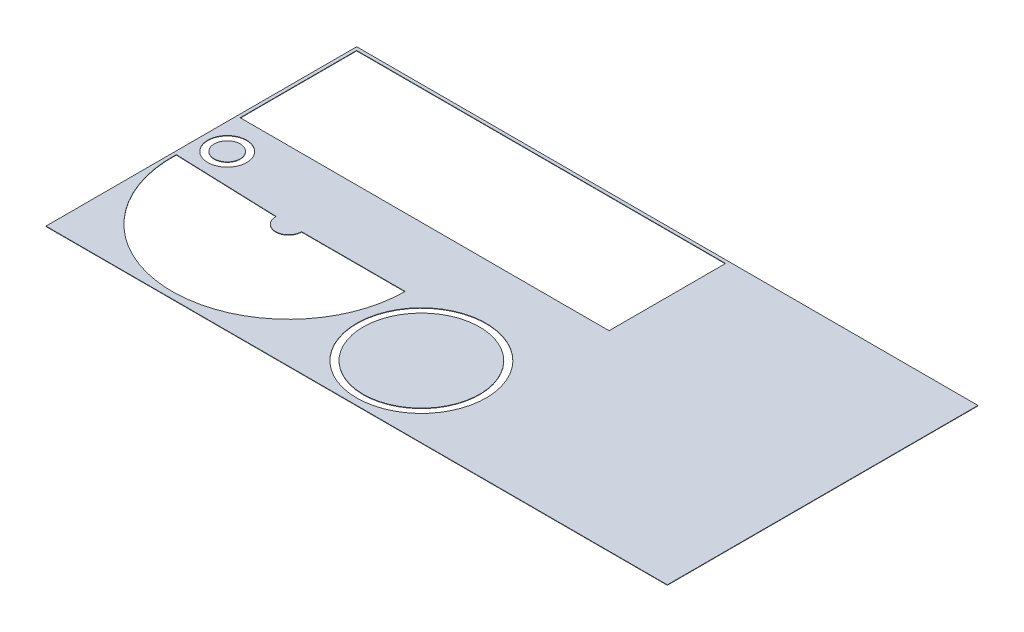
ISO-10303-21;
HEADER;
FILE_DESCRIPTION(('STEP AP214'),'2;1');
FILE_NAME('part.step','',(''),(''),'','','');
FILE_SCHEMA(('AUTOMOTIVE_DESIGN { 1 0 10303 214 1 1 1 1 }'));
ENDSEC;
DATA;
#1=APPLICATION_CONTEXT('core data for automotive mechanical design processes');
#2=APPLICATION_PROTOCOL_DEFINITION('international standard','automotive_design',2000,#1);
#3=PRODUCT_CONTEXT('',#1,'mechanical');
#4=PRODUCT('Part','Part','',(#3));
#5=PRODUCT_RELATED_PRODUCT_CATEGORY('part','',(#4));
#6=PRODUCT_DEFINITION_FORMATION('','',#4);
#7=PRODUCT_DEFINITION_CONTEXT('part definition',#1,'design');
#8=PRODUCT_DEFINITION('design','',#6,#7);
#9=PRODUCT_DEFINITION_SHAPE('','',#8);
#10=(LENGTH_UNIT() NAMED_UNIT(*) SI_UNIT(.MILLI.,.METRE.));
#11=(NAMED_UNIT(*) PLANE_ANGLE_UNIT() SI_UNIT($,.RADIAN.));
#12=(NAMED_UNIT(*) SI_UNIT($,.STERADIAN.) SOLID_ANGLE_UNIT());
#13=UNCERTAINTY_MEASURE_WITH_UNIT(LENGTH_MEASURE(1.E-05),#10,'distance_accuracy_value','');
#14=(GEOMETRIC_REPRESENTATION_CONTEXT(3) GLOBAL_UNCERTAINTY_ASSIGNED_CONTEXT((#13)) GLOBAL_UNIT_ASSIGNED_CONTEXT((#10,
#11,#12)) REPRESENTATION_CONTEXT('',''));
#15=CARTESIAN_POINT('',(0.,0.,0.));
#16=DIRECTION('',(0.,0.,1.));
#17=DIRECTION('',(1.,0.,0.));
#18=AXIS2_PLACEMENT_3D('',#15,#16,#17);
#19=CARTESIAN_POINT('',(1219.2,-1.5875,609.6));
#20=DIRECTION('',(1.,0.,0.));
#21=DIRECTION('',(0.,0.,-1.));
#22=AXIS2_PLACEMENT_3D('',#19,#20,#21);
#23=PLANE('',#22);
#24=DIRECTION('',(0.,0.,-1.));
#25=VECTOR('',#24,1.);
#26=CARTESIAN_POINT('',(1219.2,0.,609.6));
#27=LINE('',#26,#25);
#28=CARTESIAN_POINT('',(1219.2,0.,609.6));
#29=VERTEX_POINT('',#28);
#30=CARTESIAN_POINT('',(1219.2,0.,-609.6));
#31=VERTEX_POINT('',#30);
#32=EDGE_CURVE('E186',#29,#31,#27,.T.);
#33=ORIENTED_EDGE('',*,*,#32,.F.);
#34=DIRECTION('',(0.,1.,0.));
#35=VECTOR('',#34,1.);
#36=CARTESIAN_POINT('',(1219.2,-1.5875,609.6));
#37=LINE('',#36,#35);
#38=CARTESIAN_POINT('',(1219.2,-1.5875,609.6));
#39=VERTEX_POINT('',#38);
#40=EDGE_CURVE('E219',#39,#29,#37,.T.);
#41=ORIENTED_EDGE('',*,*,#40,.F.);
#42=DIRECTION('',(0.,0.,-1.));
#43=VECTOR('',#42,1.);
#44=CARTESIAN_POINT('',(1219.2,-1.5875,609.6));
#45=LINE('',#44,#43);
#46=CARTESIAN_POINT('',(1219.2,-1.5875,-609.6));
#47=VERTEX_POINT('',#46);
#48=EDGE_CURVE('E207',#39,#47,#45,.T.);
#49=ORIENTED_EDGE('',*,*,#48,.T.);
#50=DIRECTION('',(0.,1.,0.));
#51=VECTOR('',#50,1.);
#52=CARTESIAN_POINT('',(1219.2,-1.5875,-609.6));
#53=LINE('',#52,#51);
#54=EDGE_CURVE('E210',#47,#31,#53,.T.);
#55=ORIENTED_EDGE('',*,*,#54,.T.);
#56=EDGE_LOOP('',(#33,#41,#49,#55));
#57=FACE_BOUND('',#56,.T.);
#58=ADVANCED_FACE('F47',(#57),#23,.T.);
#59=CARTESIAN_POINT('',(-1219.2,-1.5875,609.6));
#60=DIRECTION('',(0.,0.,1.));
#61=DIRECTION('',(1.,0.,0.));
#62=AXIS2_PLACEMENT_3D('',#59,#60,#61);
#63=PLANE('',#62);
#64=DIRECTION('',(1.,0.,0.));
#65=VECTOR('',#64,1.);
#66=CARTESIAN_POINT('',(-1219.2,0.,609.6));
#67=LINE('',#66,#65);
#68=CARTESIAN_POINT('',(-1219.2,0.,609.6));
#69=VERTEX_POINT('',#68);
#70=EDGE_CURVE('E190',#69,#29,#67,.T.);
#71=ORIENTED_EDGE('',*,*,#70,.F.);
#72=DIRECTION('',(0.,1.,0.));
#73=VECTOR('',#72,1.);
#74=CARTESIAN_POINT('',(-1219.2,-1.5875,609.6));
#75=LINE('',#74,#73);
#76=CARTESIAN_POINT('',(-1219.2,-1.5875,609.6));
#77=VERTEX_POINT('',#76);
#78=EDGE_CURVE('E215',#77,#69,#75,.T.);
#79=ORIENTED_EDGE('',*,*,#78,.F.);
#80=DIRECTION('',(1.,0.,0.));
#81=VECTOR('',#80,1.);
#82=CARTESIAN_POINT('',(-1219.2,-1.5875,609.6));
#83=LINE('',#82,#81);
#84=EDGE_CURVE('E220',#77,#39,#83,.T.);
#85=ORIENTED_EDGE('',*,*,#84,.T.);
#86=ORIENTED_EDGE('',*,*,#40,.T.);
#87=EDGE_LOOP('',(#71,#79,#85,#86));
#88=FACE_BOUND('',#87,.T.);
#89=ADVANCED_FACE('F248',(#88),#63,.T.);
#90=CARTESIAN_POINT('',(-1219.2,-1.5875,609.6));
#91=DIRECTION('',(-1.,0.,0.));
#92=DIRECTION('',(0.,0.,1.));
#93=AXIS2_PLACEMENT_3D('',#90,#91,#92);
#94=PLANE('',#93);
#95=DIRECTION('',(0.,0.,1.));
#96=VECTOR('',#95,1.);
#97=CARTESIAN_POINT('',(-1219.2,0.,609.6));
#98=LINE('',#97,#96);
#99=CARTESIAN_POINT('',(-1219.2,0.,-609.6));
#100=VERTEX_POINT('',#99);
#101=EDGE_CURVE('E228',#100,#69,#98,.T.);
#102=ORIENTED_EDGE('',*,*,#101,.F.);
#103=DIRECTION('',(0.,1.,0.));
#104=VECTOR('',#103,1.);
#105=CARTESIAN_POINT('',(-1219.2,-1.5875,-609.6));
#106=LINE('',#105,#104);
#107=CARTESIAN_POINT('',(-1219.2,-1.5875,-609.6));
#108=VERTEX_POINT('',#107);
#109=EDGE_CURVE('E214',#108,#100,#106,.T.);
#110=ORIENTED_EDGE('',*,*,#109,.F.);
#111=DIRECTION('',(0.,0.,1.));
#112=VECTOR('',#111,1.);
#113=CARTESIAN_POINT('',(-1219.2,-1.5875,609.6));
#114=LINE('',#113,#112);
#115=EDGE_CURVE('E216',#108,#77,#114,.T.);
#116=ORIENTED_EDGE('',*,*,#115,.T.);
#117=ORIENTED_EDGE('',*,*,#78,.T.);
#118=EDGE_LOOP('',(#102,#110,#116,#117));
#119=FACE_BOUND('',#118,.T.);
#120=ADVANCED_FACE('F253',(#119),#94,.T.);
#121=CARTESIAN_POINT('',(-1219.2,-1.5875,-609.6));
#122=DIRECTION('',(0.,0.,-1.));
#123=DIRECTION('',(-1.,0.,0.));
#124=AXIS2_PLACEMENT_3D('',#121,#122,#123);
#125=PLANE('',#124);
#126=DIRECTION('',(-1.,0.,0.));
#127=VECTOR('',#126,1.);
#128=CARTESIAN_POINT('',(-1219.2,0.,-609.6));
#129=LINE('',#128,#127);
#130=EDGE_CURVE('E225',#31,#100,#129,.T.);
#131=ORIENTED_EDGE('',*,*,#130,.F.);
#132=ORIENTED_EDGE('',*,*,#54,.F.);
#133=DIRECTION('',(-1.,0.,0.));
#134=VECTOR('',#133,1.);
#135=CARTESIAN_POINT('',(-1219.2,-1.5875,-609.6));
#136=LINE('',#135,#134);
#137=EDGE_CURVE('E211',#47,#108,#136,.T.);
#138=ORIENTED_EDGE('',*,*,#137,.T.);
#139=ORIENTED_EDGE('',*,*,#109,.T.);
#140=EDGE_LOOP('',(#131,#132,#138,#139));
#141=FACE_BOUND('',#140,.T.);
#142=ADVANCED_FACE('F242',(#141),#125,.T.);
#143=CARTESIAN_POINT('',(0.,-1.5875,0.));
#144=DIRECTION('',(0.,-1.,0.));
#145=DIRECTION('',(0.,0.,-1.));
#146=AXIS2_PLACEMENT_3D('',#143,#144,#145);
#147=PLANE('',#146);
#148=CARTESIAN_POINT('',(-1117.6,-1.5875,0.));
#149=DIRECTION('',(0.,1.,0.));
#150=DIRECTION('',(0.,0.,1.));
#151=AXIS2_PLACEMENT_3D('',#148,#149,#150);
#152=CIRCLE('',#151,76.2);
#153=CARTESIAN_POINT('',(-1117.6,-1.5875,76.2));
#154=VERTEX_POINT('',#153);
#155=EDGE_CURVE('E51',#154,#154,#152,.T.);
#156=ORIENTED_EDGE('',*,*,#155,.T.);
#157=EDGE_LOOP('',(#156));
#158=FACE_BOUND('',#157,.T.);
#159=CARTESIAN_POINT('',(-25.4000000000001,-1.5875,330.2));
#160=DIRECTION('',(0.,1.,0.));
#161=DIRECTION('',(0.,0.,1.));
#162=AXIS2_PLACEMENT_3D('',#159,#160,#161);
#163=CIRCLE('',#162,254.);
#164=CARTESIAN_POINT('',(-25.4000000000001,-1.5875,584.2));
#165=VERTEX_POINT('',#164);
#166=EDGE_CURVE('E330',#165,#165,#163,.T.);
#167=ORIENTED_EDGE('',*,*,#166,.T.);
#168=EDGE_LOOP('',(#167));
#169=FACE_BOUND('',#168,.T.);
#170=CARTESIAN_POINT('',(-749.57851388687,-1.5875,127.));
#171=DIRECTION('',(0.,-1.,0.));
#172=DIRECTION('',(0.,0.,1.));
#173=AXIS2_PLACEMENT_3D('',#170,#171,#172);
#174=CIRCLE('',#173,50.8);
#175=CARTESIAN_POINT('',(-698.77851388687,-1.5875,127.));
#176=VERTEX_POINT('',#175);
#177=CARTESIAN_POINT('',(-800.34756789944,-1.5875,125.227105567513));
#178=VERTEX_POINT('',#177);
#179=EDGE_CURVE('E162',#176,#178,#174,.T.);
#180=ORIENTED_EDGE('',*,*,#179,.T.);
#181=DIRECTION('',(-0.999390827019096,0.,-0.0348994967025008));
#182=VECTOR('',#181,1.);
#183=CARTESIAN_POINT('',(-1206.5,-1.5875,111.043950107617));
#184=LINE('',#183,#182);
#185=CARTESIAN_POINT('',(-1206.5,-1.5875,111.043950107617));
#186=VERTEX_POINT('',#185);
#187=EDGE_CURVE('E160',#178,#186,#184,.T.);
#188=ORIENTED_EDGE('',*,*,#187,.T.);
#189=CARTESIAN_POINT('',(-749.57851388687,-1.5875,127.));
#190=DIRECTION('',(0.,1.,0.));
#191=DIRECTION('',(0.,0.,-1.));
#192=AXIS2_PLACEMENT_3D('',#189,#190,#191);
#193=CIRCLE('',#192,457.2);
#194=CARTESIAN_POINT('',(-292.37851388687,-1.5875,127.));
#195=VERTEX_POINT('',#194);
#196=EDGE_CURVE('E141',#186,#195,#193,.T.);
#197=ORIENTED_EDGE('',*,*,#196,.T.);
#198=DIRECTION('',(-1.,0.,0.));
#199=VECTOR('',#198,1.);
#200=CARTESIAN_POINT('',(-698.77851388687,-1.5875,127.));
#201=LINE('',#200,#199);
#202=EDGE_CURVE('E151',#195,#176,#201,.T.);
#203=ORIENTED_EDGE('',*,*,#202,.T.);
#204=EDGE_LOOP('',(#180,#188,#197,#203));
#205=FACE_BOUND('',#204,.T.);
#206=DIRECTION('',(0.,0.,1.));
#207=VECTOR('',#206,1.);
#208=CARTESIAN_POINT('',(-1206.5,-1.5875,-596.9));
#209=LINE('',#208,#207);
#210=CARTESIAN_POINT('',(-1206.5,-1.5875,-596.9));
#211=VERTEX_POINT('',#210);
#212=CARTESIAN_POINT('',(-1206.5,-1.5875,-139.7));
#213=VERTEX_POINT('',#212);
#214=EDGE_CURVE('E156',#211,#213,#209,.T.);
#215=ORIENTED_EDGE('',*,*,#214,.T.);
#216=DIRECTION('',(1.,0.,0.));
#217=VECTOR('',#216,1.);
#218=CARTESIAN_POINT('',(-1206.5,-1.5875,-139.7));
#219=LINE('',#218,#217);
#220=CARTESIAN_POINT('',(241.3,-1.5875,-139.7));
#221=VERTEX_POINT('',#220);
#222=EDGE_CURVE('E177',#213,#221,#219,.T.);
#223=ORIENTED_EDGE('',*,*,#222,.T.);
#224=DIRECTION('',(0.,0.,-1.));
#225=VECTOR('',#224,1.);
#226=CARTESIAN_POINT('',(241.3,-1.5875,-596.9));
#227=LINE('',#226,#225);
#228=CARTESIAN_POINT('',(241.3,-1.5875,-596.9));
#229=VERTEX_POINT('',#228);
#230=EDGE_CURVE('E180',#221,#229,#227,.T.);
#231=ORIENTED_EDGE('',*,*,#230,.T.);
#232=DIRECTION('',(-1.,0.,0.));
#233=VECTOR('',#232,1.);
#234=CARTESIAN_POINT('',(-1206.5,-1.5875,-596.9));
#235=LINE('',#234,#233);
#236=EDGE_CURVE('E183',#229,#211,#235,.T.);
#237=ORIENTED_EDGE('',*,*,#236,.T.);
#238=EDGE_LOOP('',(#215,#223,#231,#237));
#239=FACE_BOUND('',#238,.T.);
#240=ORIENTED_EDGE('',*,*,#48,.F.);
#241=ORIENTED_EDGE('',*,*,#84,.F.);
#242=ORIENTED_EDGE('',*,*,#115,.F.);
#243=ORIENTED_EDGE('',*,*,#137,.F.);
#244=EDGE_LOOP('',(#240,#241,#242,#243));
#245=FACE_BOUND('',#244,.T.);
#246=ADVANCED_FACE('F49',(#158,#169,#205,#239,#245),#147,.T.);
#247=CARTESIAN_POINT('',(0.,0.,0.));
#248=DIRECTION('',(0.,-1.,0.));
#249=DIRECTION('',(0.,0.,-1.));
#250=AXIS2_PLACEMENT_3D('',#247,#248,#249);
#251=PLANE('',#250);
#252=CARTESIAN_POINT('',(-1117.6,0.,0.));
#253=DIRECTION('',(0.,1.,0.));
#254=DIRECTION('',(0.,0.,1.));
#255=AXIS2_PLACEMENT_3D('',#252,#253,#254);
#256=CIRCLE('',#255,76.2);
#257=CARTESIAN_POINT('',(-1117.6,0.,76.2));
#258=VERTEX_POINT('',#257);
#259=EDGE_CURVE('E12',#258,#258,#256,.T.);
#260=ORIENTED_EDGE('',*,*,#259,.F.);
#261=EDGE_LOOP('',(#260));
#262=FACE_BOUND('',#261,.T.);
#263=CARTESIAN_POINT('',(-25.4000000000001,0.,330.2));
#264=DIRECTION('',(0.,1.,0.));
#265=DIRECTION('',(0.,0.,1.));
#266=AXIS2_PLACEMENT_3D('',#263,#264,#265);
#267=CIRCLE('',#266,254.);
#268=CARTESIAN_POINT('',(-25.4000000000001,0.,584.2));
#269=VERTEX_POINT('',#268);
#270=EDGE_CURVE('E57',#269,#269,#267,.T.);
#271=ORIENTED_EDGE('',*,*,#270,.F.);
#272=EDGE_LOOP('',(#271));
#273=FACE_BOUND('',#272,.T.);
#274=DIRECTION('',(-0.999390827019096,0.,-0.0348994967025008));
#275=VECTOR('',#274,1.);
#276=CARTESIAN_POINT('',(-1206.5,0.,111.043950107617));
#277=LINE('',#276,#275);
#278=CARTESIAN_POINT('',(-800.347567899439,0.,125.227105567513));
#279=VERTEX_POINT('',#278);
#280=CARTESIAN_POINT('',(-1206.5,0.,111.043950107617));
#281=VERTEX_POINT('',#280);
#282=EDGE_CURVE('E168',#279,#281,#277,.T.);
#283=ORIENTED_EDGE('',*,*,#282,.F.);
#284=CARTESIAN_POINT('',(-749.57851388687,0.,127.));
#285=DIRECTION('',(0.,-1.,0.));
#286=DIRECTION('',(0.,0.,1.));
#287=AXIS2_PLACEMENT_3D('',#284,#285,#286);
#288=CIRCLE('',#287,50.8);
#289=CARTESIAN_POINT('',(-698.77851388687,0.,127.));
#290=VERTEX_POINT('',#289);
#291=EDGE_CURVE('E130',#290,#279,#288,.T.);
#292=ORIENTED_EDGE('',*,*,#291,.F.);
#293=DIRECTION('',(-1.,0.,0.));
#294=VECTOR('',#293,1.);
#295=CARTESIAN_POINT('',(-698.77851388687,0.,127.));
#296=LINE('',#295,#294);
#297=CARTESIAN_POINT('',(-292.37851388687,0.,127.));
#298=VERTEX_POINT('',#297);
#299=EDGE_CURVE('E147',#298,#290,#296,.T.);
#300=ORIENTED_EDGE('',*,*,#299,.F.);
#301=CARTESIAN_POINT('',(-749.57851388687,0.,127.));
#302=DIRECTION('',(0.,1.,0.));
#303=DIRECTION('',(0.,0.,-1.));
#304=AXIS2_PLACEMENT_3D('',#301,#302,#303);
#305=CIRCLE('',#304,457.2);
#306=EDGE_CURVE('E143',#281,#298,#305,.T.);
#307=ORIENTED_EDGE('',*,*,#306,.F.);
#308=EDGE_LOOP('',(#283,#292,#300,#307));
#309=FACE_BOUND('',#308,.T.);
#310=DIRECTION('',(1.,0.,0.));
#311=VECTOR('',#310,1.);
#312=CARTESIAN_POINT('',(-1206.5,0.,-139.7));
#313=LINE('',#312,#311);
#314=CARTESIAN_POINT('',(-1206.5,0.,-139.7));
#315=VERTEX_POINT('',#314);
#316=CARTESIAN_POINT('',(241.3,0.,-139.7));
#317=VERTEX_POINT('',#316);
#318=EDGE_CURVE('E191',#315,#317,#313,.T.);
#319=ORIENTED_EDGE('',*,*,#318,.F.);
#320=DIRECTION('',(0.,0.,1.));
#321=VECTOR('',#320,1.);
#322=CARTESIAN_POINT('',(-1206.5,0.,-596.9));
#323=LINE('',#322,#321);
#324=CARTESIAN_POINT('',(-1206.5,0.,-596.9));
#325=VERTEX_POINT('',#324);
#326=EDGE_CURVE('E187',#325,#315,#323,.T.);
#327=ORIENTED_EDGE('',*,*,#326,.F.);
#328=DIRECTION('',(-1.,0.,0.));
#329=VECTOR('',#328,1.);
#330=CARTESIAN_POINT('',(-1206.5,0.,-596.9));
#331=LINE('',#330,#329);
#332=CARTESIAN_POINT('',(241.3,0.,-596.9));
#333=VERTEX_POINT('',#332);
#334=EDGE_CURVE('E199',#333,#325,#331,.T.);
#335=ORIENTED_EDGE('',*,*,#334,.F.);
#336=DIRECTION('',(0.,0.,-1.));
#337=VECTOR('',#336,1.);
#338=CARTESIAN_POINT('',(241.3,0.,-596.9));
#339=LINE('',#338,#337);
#340=EDGE_CURVE('E195',#317,#333,#339,.T.);
#341=ORIENTED_EDGE('',*,*,#340,.F.);
#342=EDGE_LOOP('',(#319,#327,#335,#341));
#343=FACE_BOUND('',#342,.T.);
#344=ORIENTED_EDGE('',*,*,#32,.T.);
#345=ORIENTED_EDGE('',*,*,#130,.T.);
#346=ORIENTED_EDGE('',*,*,#101,.T.);
#347=ORIENTED_EDGE('',*,*,#70,.T.);
#348=EDGE_LOOP('',(#344,#345,#346,#347));
#349=FACE_BOUND('',#348,.T.);
#350=ADVANCED_FACE('F245',(#262,#273,#309,#343,#349),#251,.F.);
#351=CARTESIAN_POINT('',(-1206.5,-1.5875,-596.9));
#352=DIRECTION('',(-1.,0.,0.));
#353=DIRECTION('',(0.,0.,1.));
#354=AXIS2_PLACEMENT_3D('',#351,#352,#353);
#355=PLANE('',#354);
#356=ORIENTED_EDGE('',*,*,#326,.T.);
#357=DIRECTION('',(0.,1.,0.));
#358=VECTOR('',#357,1.);
#359=CARTESIAN_POINT('',(-1206.5,-1.5875,-139.7));
#360=LINE('',#359,#358);
#361=EDGE_CURVE('E167',#213,#315,#360,.T.);
#362=ORIENTED_EDGE('',*,*,#361,.F.);
#363=ORIENTED_EDGE('',*,*,#214,.F.);
#364=DIRECTION('',(0.,1.,0.));
#365=VECTOR('',#364,1.);
#366=CARTESIAN_POINT('',(-1206.5,-1.5875,-596.9));
#367=LINE('',#366,#365);
#368=EDGE_CURVE('E189',#211,#325,#367,.T.);
#369=ORIENTED_EDGE('',*,*,#368,.T.);
#370=EDGE_LOOP('',(#356,#362,#363,#369));
#371=FACE_BOUND('',#370,.T.);
#372=ADVANCED_FACE('F272',(#371),#355,.F.);
#373=CARTESIAN_POINT('',(-1206.5,-1.5875,-596.9));
#374=DIRECTION('',(0.,0.,-1.));
#375=DIRECTION('',(-1.,0.,0.));
#376=AXIS2_PLACEMENT_3D('',#373,#374,#375);
#377=PLANE('',#376);
#378=ORIENTED_EDGE('',*,*,#334,.T.);
#379=ORIENTED_EDGE('',*,*,#368,.F.);
#380=ORIENTED_EDGE('',*,*,#236,.F.);
#381=DIRECTION('',(0.,1.,0.));
#382=VECTOR('',#381,1.);
#383=CARTESIAN_POINT('',(241.3,-1.5875,-596.9));
#384=LINE('',#383,#382);
#385=EDGE_CURVE('E198',#229,#333,#384,.T.);
#386=ORIENTED_EDGE('',*,*,#385,.T.);
#387=EDGE_LOOP('',(#378,#379,#380,#386));
#388=FACE_BOUND('',#387,.T.);
#389=ADVANCED_FACE('F279',(#388),#377,.F.);
#390=CARTESIAN_POINT('',(241.3,-1.5875,-596.9));
#391=DIRECTION('',(1.,0.,0.));
#392=DIRECTION('',(0.,0.,-1.));
#393=AXIS2_PLACEMENT_3D('',#390,#391,#392);
#394=PLANE('',#393);
#395=ORIENTED_EDGE('',*,*,#340,.T.);
#396=ORIENTED_EDGE('',*,*,#385,.F.);
#397=ORIENTED_EDGE('',*,*,#230,.F.);
#398=DIRECTION('',(0.,1.,0.));
#399=VECTOR('',#398,1.);
#400=CARTESIAN_POINT('',(241.3,-1.5875,-139.7));
#401=LINE('',#400,#399);
#402=EDGE_CURVE('E194',#221,#317,#401,.T.);
#403=ORIENTED_EDGE('',*,*,#402,.T.);
#404=EDGE_LOOP('',(#395,#396,#397,#403));
#405=FACE_BOUND('',#404,.T.);
#406=ADVANCED_FACE('F302',(#405),#394,.F.);
#407=CARTESIAN_POINT('',(-1206.5,-1.5875,-139.7));
#408=DIRECTION('',(0.,0.,1.));
#409=DIRECTION('',(1.,0.,0.));
#410=AXIS2_PLACEMENT_3D('',#407,#408,#409);
#411=PLANE('',#410);
#412=ORIENTED_EDGE('',*,*,#318,.T.);
#413=ORIENTED_EDGE('',*,*,#402,.F.);
#414=ORIENTED_EDGE('',*,*,#222,.F.);
#415=ORIENTED_EDGE('',*,*,#361,.T.);
#416=EDGE_LOOP('',(#412,#413,#414,#415));
#417=FACE_BOUND('',#416,.T.);
#418=ADVANCED_FACE('F296',(#417),#411,.F.);
#419=CARTESIAN_POINT('',(-749.57851388687,-1.5875,127.));
#420=DIRECTION('',(0.,1.,0.));
#421=DIRECTION('',(0.,0.,1.));
#422=AXIS2_PLACEMENT_3D('',#419,#420,#421);
#423=CYLINDRICAL_SURFACE('',#422,50.8);
#424=ORIENTED_EDGE('',*,*,#291,.T.);
#425=DIRECTION('',(0.,1.,0.));
#426=VECTOR('',#425,1.);
#427=CARTESIAN_POINT('',(-800.34756789944,-1.5875,125.227105567513));
#428=LINE('',#427,#426);
#429=EDGE_CURVE('E134',#178,#279,#428,.T.);
#430=ORIENTED_EDGE('',*,*,#429,.F.);
#431=ORIENTED_EDGE('',*,*,#179,.F.);
#432=DIRECTION('',(0.,1.,0.));
#433=VECTOR('',#432,1.);
#434=CARTESIAN_POINT('',(-698.77851388687,-1.5875,127.));
#435=LINE('',#434,#433);
#436=EDGE_CURVE('E153',#176,#290,#435,.T.);
#437=ORIENTED_EDGE('',*,*,#436,.T.);
#438=EDGE_LOOP('',(#424,#430,#431,#437));
#439=FACE_BOUND('',#438,.T.);
#440=ADVANCED_FACE('F309',(#439),#423,.T.);
#441=CARTESIAN_POINT('',(-698.77851388687,-1.5875,127.));
#442=DIRECTION('',(0.,0.,-1.));
#443=DIRECTION('',(-1.,0.,0.));
#444=AXIS2_PLACEMENT_3D('',#441,#442,#443);
#445=PLANE('',#444);
#446=ORIENTED_EDGE('',*,*,#299,.T.);
#447=ORIENTED_EDGE('',*,*,#436,.F.);
#448=ORIENTED_EDGE('',*,*,#202,.F.);
#449=DIRECTION('',(0.,1.,0.));
#450=VECTOR('',#449,1.);
#451=CARTESIAN_POINT('',(-292.37851388687,-1.5875,127.));
#452=LINE('',#451,#450);
#453=EDGE_CURVE('E137',#195,#298,#452,.T.);
#454=ORIENTED_EDGE('',*,*,#453,.T.);
#455=EDGE_LOOP('',(#446,#447,#448,#454));
#456=FACE_BOUND('',#455,.T.);
#457=ADVANCED_FACE('F152',(#456),#445,.F.);
#458=CARTESIAN_POINT('',(-749.57851388687,-1.5875,127.));
#459=DIRECTION('',(0.,1.,0.));
#460=DIRECTION('',(0.,0.,1.));
#461=AXIS2_PLACEMENT_3D('',#458,#459,#460);
#462=CYLINDRICAL_SURFACE('',#461,457.2);
#463=ORIENTED_EDGE('',*,*,#306,.T.);
#464=ORIENTED_EDGE('',*,*,#453,.F.);
#465=ORIENTED_EDGE('',*,*,#196,.F.);
#466=DIRECTION('',(0.,1.,0.));
#467=VECTOR('',#466,1.);
#468=CARTESIAN_POINT('',(-1206.5,-1.5875,111.043950107617));
#469=LINE('',#468,#467);
#470=EDGE_CURVE('E64',#186,#281,#469,.T.);
#471=ORIENTED_EDGE('',*,*,#470,.T.);
#472=EDGE_LOOP('',(#463,#464,#465,#471));
#473=FACE_BOUND('',#472,.T.);
#474=ADVANCED_FACE('F139',(#473),#462,.F.);
#475=CARTESIAN_POINT('',(-1206.5,-1.5875,111.043950107617));
#476=DIRECTION('',(0.0348994967025008,0.,-0.999390827019096));
#477=DIRECTION('',(-0.999390827019096,0.,-0.0348994967025008));
#478=AXIS2_PLACEMENT_3D('',#475,#476,#477);
#479=PLANE('',#478);
#480=ORIENTED_EDGE('',*,*,#282,.T.);
#481=ORIENTED_EDGE('',*,*,#470,.F.);
#482=ORIENTED_EDGE('',*,*,#187,.F.);
#483=ORIENTED_EDGE('',*,*,#429,.T.);
#484=EDGE_LOOP('',(#480,#481,#482,#483));
#485=FACE_BOUND('',#484,.T.);
#486=ADVANCED_FACE('F315',(#485),#479,.F.);
#487=CARTESIAN_POINT('',(-25.4000000000001,-1.5875,330.2));
#488=DIRECTION('',(0.,1.,0.));
#489=DIRECTION('',(0.,0.,1.));
#490=AXIS2_PLACEMENT_3D('',#487,#488,#489);
#491=CYLINDRICAL_SURFACE('',#490,254.);
#492=ORIENTED_EDGE('',*,*,#166,.F.);
#493=EDGE_LOOP('',(#492));
#494=FACE_BOUND('',#493,.T.);
#495=ORIENTED_EDGE('',*,*,#270,.T.);
#496=EDGE_LOOP('',(#495));
#497=FACE_BOUND('',#496,.T.);
#498=ADVANCED_FACE('F269',(#494,#497),#491,.F.);
#499=CARTESIAN_POINT('',(-1117.6,-1.5875,0.));
#500=DIRECTION('',(0.,1.,0.));
#501=DIRECTION('',(0.,0.,1.));
#502=AXIS2_PLACEMENT_3D('',#499,#500,#501);
#503=CYLINDRICAL_SURFACE('',#502,76.2);
#504=ORIENTED_EDGE('',*,*,#155,.F.);
#505=EDGE_LOOP('',(#504));
#506=FACE_BOUND('',#505,.T.);
#507=ORIENTED_EDGE('',*,*,#259,.T.);
#508=EDGE_LOOP('',(#507));
#509=FACE_BOUND('',#508,.T.);
#510=ADVANCED_FACE('F267',(#506,#509),#503,.F.);
#511=CLOSED_SHELL('',(#58,#89,#120,#142,#246,#350,#372,#389,#406,#418,#440,#457,#474,#486,#498,#510));
#512=MANIFOLD_SOLID_BREP('B2',#511);
#513=CARTESIAN_POINT('',(0.,0.,0.));
#514=DIRECTION('',(0.,-1.,0.));
#515=DIRECTION('',(0.,0.,-1.));
#516=AXIS2_PLACEMENT_3D('',#513,#514,#515);
#517=PLANE('',#516);
#518=CARTESIAN_POINT('',(-1117.6,0.,0.));
#519=DIRECTION('',(0.,1.,0.));
#520=DIRECTION('',(0.,0.,1.));
#521=AXIS2_PLACEMENT_3D('',#518,#519,#520);
#522=CIRCLE('',#521,50.8);
#523=CARTESIAN_POINT('',(-1117.6,0.,50.8));
#524=VERTEX_POINT('',#523);
#525=EDGE_CURVE('E467',#524,#524,#522,.T.);
#526=ORIENTED_EDGE('',*,*,#525,.T.);
#527=EDGE_LOOP('',(#526));
#528=FACE_BOUND('',#527,.T.);
#529=ADVANCED_FACE('F463',(#528),#517,.F.);
#530=CARTESIAN_POINT('',(-1117.6,-1.5875,0.));
#531=DIRECTION('',(0.,1.,0.));
#532=DIRECTION('',(0.,0.,1.));
#533=AXIS2_PLACEMENT_3D('',#530,#531,#532);
#534=CYLINDRICAL_SURFACE('',#533,50.8);
#535=CARTESIAN_POINT('',(-1117.6,-1.5875,0.));
#536=DIRECTION('',(0.,1.,0.));
#537=DIRECTION('',(0.,0.,1.));
#538=AXIS2_PLACEMENT_3D('',#535,#536,#537);
#539=CIRCLE('',#538,50.8);
#540=CARTESIAN_POINT('',(-1117.6,-1.5875,50.8));
#541=VERTEX_POINT('',#540);
#542=EDGE_CURVE('E46',#541,#541,#539,.T.);
#543=ORIENTED_EDGE('',*,*,#542,.T.);
#544=EDGE_LOOP('',(#543));
#545=FACE_BOUND('',#544,.T.);
#546=ORIENTED_EDGE('',*,*,#525,.F.);
#547=EDGE_LOOP('',(#546));
#548=FACE_BOUND('',#547,.T.);
#549=ADVANCED_FACE('F477',(#545,#548),#534,.T.);
#550=CARTESIAN_POINT('',(0.,-1.5875,0.));
#551=DIRECTION('',(0.,-1.,0.));
#552=DIRECTION('',(0.,0.,-1.));
#553=AXIS2_PLACEMENT_3D('',#550,#551,#552);
#554=PLANE('',#553);
#555=ORIENTED_EDGE('',*,*,#542,.F.);
#556=EDGE_LOOP('',(#555));
#557=FACE_BOUND('',#556,.T.);
#558=ADVANCED_FACE('F465',(#557),#554,.T.);
#559=CLOSED_SHELL('',(#529,#549,#558));
#560=MANIFOLD_SOLID_BREP('B6',#559);
#561=CARTESIAN_POINT('',(0.,0.,0.));
#562=DIRECTION('',(0.,-1.,0.));
#563=DIRECTION('',(0.,0.,-1.));
#564=AXIS2_PLACEMENT_3D('',#561,#562,#563);
#565=PLANE('',#564);
#566=CARTESIAN_POINT('',(-25.4000000000001,0.,330.2));
#567=DIRECTION('',(0.,1.,0.));
#568=DIRECTION('',(0.,0.,1.));
#569=AXIS2_PLACEMENT_3D('',#566,#567,#568);
#570=CIRCLE('',#569,228.6);
#571=CARTESIAN_POINT('',(-25.4000000000001,0.,558.8));
#572=VERTEX_POINT('',#571);
#573=EDGE_CURVE('E512',#572,#572,#570,.T.);
#574=ORIENTED_EDGE('',*,*,#573,.T.);
#575=EDGE_LOOP('',(#574));
#576=FACE_BOUND('',#575,.T.);
#577=ADVANCED_FACE('F509',(#576),#565,.F.);
#578=CARTESIAN_POINT('',(-25.4000000000001,-1.5875,330.2));
#579=DIRECTION('',(0.,1.,0.));
#580=DIRECTION('',(0.,0.,1.));
#581=AXIS2_PLACEMENT_3D('',#578,#579,#580);
#582=CYLINDRICAL_SURFACE('',#581,228.6);
#583=CARTESIAN_POINT('',(-25.4000000000001,-1.5875,330.2));
#584=DIRECTION('',(0.,1.,0.));
#585=DIRECTION('',(0.,0.,1.));
#586=AXIS2_PLACEMENT_3D('',#583,#584,#585);
#587=CIRCLE('',#586,228.6);
#588=CARTESIAN_POINT('',(-25.4000000000001,-1.5875,558.8));
#589=VERTEX_POINT('',#588);
#590=EDGE_CURVE('E462',#589,#589,#587,.T.);
#591=ORIENTED_EDGE('',*,*,#590,.T.);
#592=EDGE_LOOP('',(#591));
#593=FACE_BOUND('',#592,.T.);
#594=ORIENTED_EDGE('',*,*,#573,.F.);
#595=EDGE_LOOP('',(#594));
#596=FACE_BOUND('',#595,.T.);
#597=ADVANCED_FACE('F522',(#593,#596),#582,.T.);
#598=CARTESIAN_POINT('',(0.,-1.5875,0.));
#599=DIRECTION('',(0.,-1.,0.));
#600=DIRECTION('',(0.,0.,-1.));
#601=AXIS2_PLACEMENT_3D('',#598,#599,#600);
#602=PLANE('',#601);
#603=ORIENTED_EDGE('',*,*,#590,.F.);
#604=EDGE_LOOP('',(#603));
#605=FACE_BOUND('',#604,.T.);
#606=ADVANCED_FACE('F524',(#605),#602,.T.);
#607=CLOSED_SHELL('',(#577,#597,#606));
#608=MANIFOLD_SOLID_BREP('B41',#607);
#609=ADVANCED_BREP_SHAPE_REPRESENTATION('',(#18,#512,#560,#608),#14);
#610=SHAPE_DEFINITION_REPRESENTATION(#9,#609);
ENDSEC;
END-ISO-10303-21;
